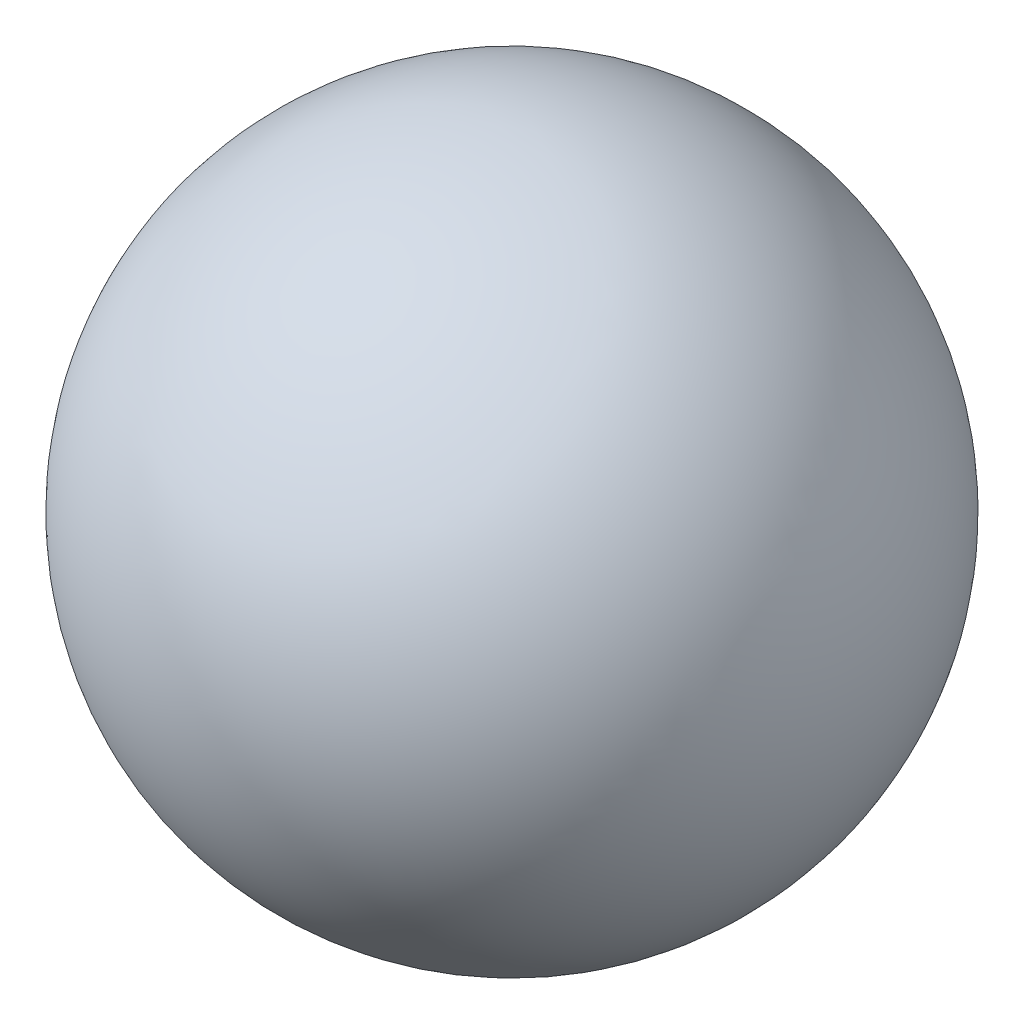
ISO-10303-21;
HEADER;
FILE_DESCRIPTION(('STEP AP214'),'2;1');
FILE_NAME('part.step','',(''),(''),'','','');
FILE_SCHEMA(('AUTOMOTIVE_DESIGN { 1 0 10303 214 1 1 1 1 }'));
ENDSEC;
DATA;
#1=APPLICATION_CONTEXT('core data for automotive mechanical design processes');
#2=APPLICATION_PROTOCOL_DEFINITION('international standard','automotive_design',2000,#1);
#3=PRODUCT_CONTEXT('',#1,'mechanical');
#4=PRODUCT('Part','Part','',(#3));
#5=PRODUCT_RELATED_PRODUCT_CATEGORY('part','',(#4));
#6=PRODUCT_DEFINITION_FORMATION('','',#4);
#7=PRODUCT_DEFINITION_CONTEXT('part definition',#1,'design');
#8=PRODUCT_DEFINITION('design','',#6,#7);
#9=PRODUCT_DEFINITION_SHAPE('','',#8);
#10=(LENGTH_UNIT() NAMED_UNIT(*) SI_UNIT(.MILLI.,.METRE.));
#11=(NAMED_UNIT(*) PLANE_ANGLE_UNIT() SI_UNIT($,.RADIAN.));
#12=(NAMED_UNIT(*) SI_UNIT($,.STERADIAN.) SOLID_ANGLE_UNIT());
#13=UNCERTAINTY_MEASURE_WITH_UNIT(LENGTH_MEASURE(1.E-05),#10,'distance_accuracy_value','');
#14=(GEOMETRIC_REPRESENTATION_CONTEXT(3) GLOBAL_UNCERTAINTY_ASSIGNED_CONTEXT((#13)) GLOBAL_UNIT_ASSIGNED_CONTEXT((#10,
#11,#12)) REPRESENTATION_CONTEXT('',''));
#15=CARTESIAN_POINT('',(0.,0.,0.));
#16=DIRECTION('',(0.,0.,1.));
#17=DIRECTION('',(1.,0.,0.));
#18=AXIS2_PLACEMENT_3D('',#15,#16,#17);
#19=CARTESIAN_POINT('',(0.,0.,0.));
#20=DIRECTION('',(-1.,0.,0.));
#21=DIRECTION('',(0.,-1.,0.));
#22=AXIS2_PLACEMENT_3D('',#19,#20,#21);
#23=SPHERICAL_SURFACE('',#22,127.);
#24=CARTESIAN_POINT('',(-127.,0.,0.));
#25=VERTEX_POINT('',#24);
#26=VERTEX_LOOP('',#25);
#27=FACE_BOUND('',#26,.T.);
#28=ADVANCED_FACE('F29',(#27),#23,.T.);
#29=CLOSED_SHELL('',(#28));
#30=MANIFOLD_SOLID_BREP('B2',#29);
#31=ADVANCED_BREP_SHAPE_REPRESENTATION('',(#18,#30),#14);
#32=SHAPE_DEFINITION_REPRESENTATION(#9,#31);
ENDSEC;
END-ISO-10303-21;
